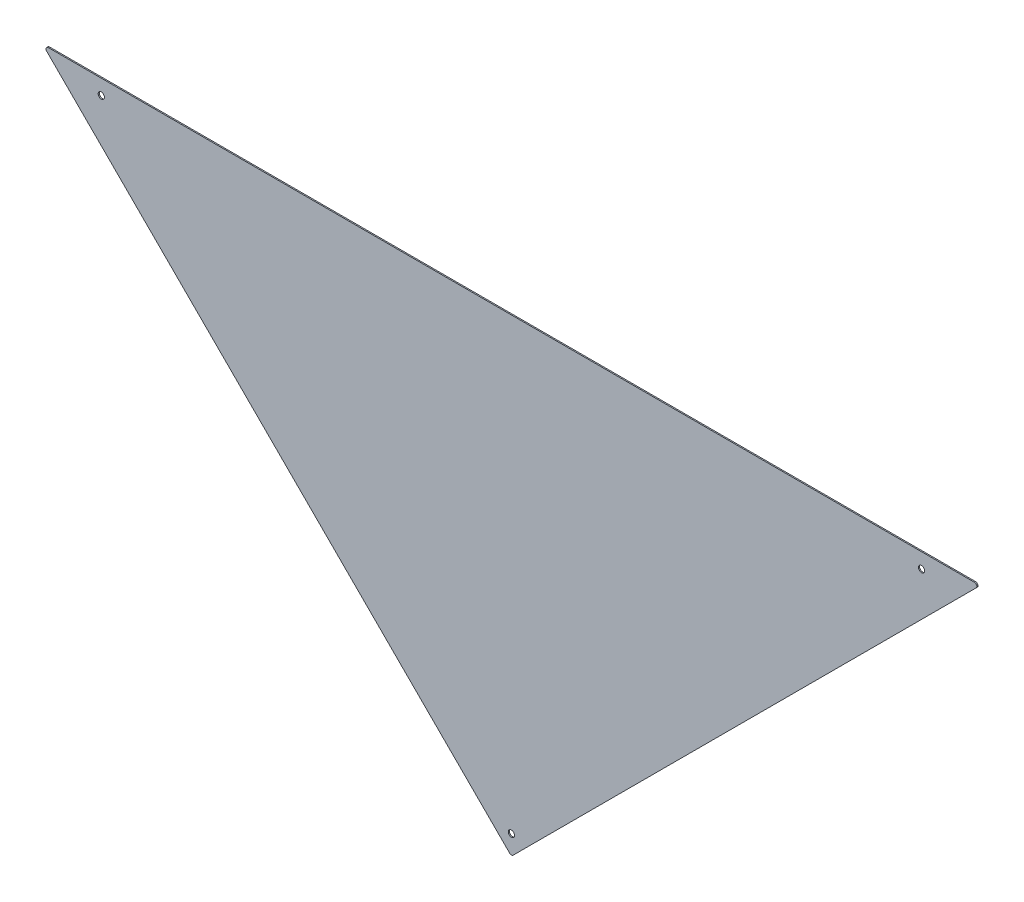
ISO-10303-21;
HEADER;
FILE_DESCRIPTION(('STEP AP214'),'2;1');
FILE_NAME('part.step','',(''),(''),'','','');
FILE_SCHEMA(('AUTOMOTIVE_DESIGN { 1 0 10303 214 1 1 1 1 }'));
ENDSEC;
DATA;
#1=APPLICATION_CONTEXT('core data for automotive mechanical design processes');
#2=APPLICATION_PROTOCOL_DEFINITION('international standard','automotive_design',2000,#1);
#3=PRODUCT_CONTEXT('',#1,'mechanical');
#4=PRODUCT('Part','Part','',(#3));
#5=PRODUCT_RELATED_PRODUCT_CATEGORY('part','',(#4));
#6=PRODUCT_DEFINITION_FORMATION('','',#4);
#7=PRODUCT_DEFINITION_CONTEXT('part definition',#1,'design');
#8=PRODUCT_DEFINITION('design','',#6,#7);
#9=PRODUCT_DEFINITION_SHAPE('','',#8);
#10=(LENGTH_UNIT() NAMED_UNIT(*) SI_UNIT(.MILLI.,.METRE.));
#11=(NAMED_UNIT(*) PLANE_ANGLE_UNIT() SI_UNIT($,.RADIAN.));
#12=(NAMED_UNIT(*) SI_UNIT($,.STERADIAN.) SOLID_ANGLE_UNIT());
#13=UNCERTAINTY_MEASURE_WITH_UNIT(LENGTH_MEASURE(1.E-05),#10,'distance_accuracy_value','');
#14=(GEOMETRIC_REPRESENTATION_CONTEXT(3) GLOBAL_UNCERTAINTY_ASSIGNED_CONTEXT((#13)) GLOBAL_UNIT_ASSIGNED_CONTEXT((#10,
#11,#12)) REPRESENTATION_CONTEXT('',''));
#15=CARTESIAN_POINT('',(0.,0.,0.));
#16=DIRECTION('',(0.,0.,1.));
#17=DIRECTION('',(1.,0.,0.));
#18=AXIS2_PLACEMENT_3D('',#15,#16,#17);
#19=CARTESIAN_POINT('',(9.65894031423886E-12,8.48528137422899,1.50000000000006));
#20=DIRECTION('',(0.,0.,-1.));
#21=DIRECTION('',(-1.,0.,0.));
#22=AXIS2_PLACEMENT_3D('',#19,#20,#21);
#23=CYLINDRICAL_SURFACE('',#22,2.99999999999999);
#24=CARTESIAN_POINT('',(9.65894031423886E-12,8.48528137422899,0.));
#25=DIRECTION('',(0.,0.,1.));
#26=DIRECTION('',(1.,0.,0.));
#27=AXIS2_PLACEMENT_3D('',#24,#25,#26);
#28=CIRCLE('',#27,2.99999999999999);
#29=CARTESIAN_POINT('',(2.12132034356932,6.36396103066933,0.));
#30=VERTEX_POINT('',#29);
#31=CARTESIAN_POINT('',(-2.12132034355002,6.36396103066939,0.));
#32=VERTEX_POINT('',#31);
#33=EDGE_CURVE('E129',#30,#32,#28,.F.);
#34=ORIENTED_EDGE('',*,*,#33,.F.);
#35=DIRECTION('',(0.,0.,-1.));
#36=VECTOR('',#35,1.);
#37=CARTESIAN_POINT('',(2.12132034356932,6.36396103066933,1.50000000000006));
#38=LINE('',#37,#36);
#39=CARTESIAN_POINT('',(2.12132034356932,6.36396103066933,1.50000000000006));
#40=VERTEX_POINT('',#39);
#41=EDGE_CURVE('E11',#40,#30,#38,.T.);
#42=ORIENTED_EDGE('',*,*,#41,.F.);
#43=CARTESIAN_POINT('',(9.65894031423886E-12,8.48528137422899,1.50000000000006));
#44=DIRECTION('',(0.,0.,1.));
#45=DIRECTION('',(1.,0.,0.));
#46=AXIS2_PLACEMENT_3D('',#43,#44,#45);
#47=CIRCLE('',#46,2.99999999999999);
#48=CARTESIAN_POINT('',(-2.12132034355002,6.36396103066939,1.50000000000006));
#49=VERTEX_POINT('',#48);
#50=EDGE_CURVE('E195',#40,#49,#47,.F.);
#51=ORIENTED_EDGE('',*,*,#50,.T.);
#52=DIRECTION('',(0.,0.,-1.));
#53=VECTOR('',#52,1.);
#54=CARTESIAN_POINT('',(-2.12132034355002,6.36396103066939,1.50000000000006));
#55=LINE('',#54,#53);
#56=EDGE_CURVE('E79',#49,#32,#55,.T.);
#57=ORIENTED_EDGE('',*,*,#56,.T.);
#58=EDGE_LOOP('',(#34,#42,#51,#57));
#59=FACE_BOUND('',#58,.T.);
#60=ADVANCED_FACE('F34',(#59),#23,.T.);
#61=CARTESIAN_POINT('',(-2.12132034355001,2.12132034355001,1.50000000000006));
#62=DIRECTION('',(-0.707106781186548,0.707106781186547,0.));
#63=DIRECTION('',(-0.707106781186547,-0.707106781186548,0.));
#64=AXIS2_PLACEMENT_3D('',#61,#62,#63);
#65=PLANE('',#64);
#66=DIRECTION('',(0.707106781186547,0.707106781186548,0.));
#67=VECTOR('',#66,1.);
#68=CARTESIAN_POINT('',(-2.12132034355001,2.12132034355001,0.));
#69=LINE('',#68,#67);
#70=CARTESIAN_POINT('',(594.87867965645,599.12132034355,0.));
#71=VERTEX_POINT('',#70);
#72=EDGE_CURVE('E127',#30,#71,#69,.T.);
#73=ORIENTED_EDGE('',*,*,#72,.T.);
#74=DIRECTION('',(0.,0.,-1.));
#75=VECTOR('',#74,1.);
#76=CARTESIAN_POINT('',(594.87867965645,599.12132034355,1.50000000000006));
#77=LINE('',#76,#75);
#78=CARTESIAN_POINT('',(594.87867965645,599.12132034355,1.50000000000006));
#79=VERTEX_POINT('',#78);
#80=EDGE_CURVE('E43',#79,#71,#77,.T.);
#81=ORIENTED_EDGE('',*,*,#80,.F.);
#82=DIRECTION('',(0.707106781186547,0.707106781186548,0.));
#83=VECTOR('',#82,1.);
#84=CARTESIAN_POINT('',(-2.12132034355001,2.12132034355001,1.50000000000006));
#85=LINE('',#84,#83);
#86=EDGE_CURVE('E197',#40,#79,#85,.T.);
#87=ORIENTED_EDGE('',*,*,#86,.F.);
#88=ORIENTED_EDGE('',*,*,#41,.T.);
#89=EDGE_LOOP('',(#73,#81,#87,#88));
#90=FACE_BOUND('',#89,.T.);
#91=ADVANCED_FACE('F128',(#90),#65,.F.);
#92=CARTESIAN_POINT('',(592.75735931289,601.24264068711,1.50000000000006));
#93=DIRECTION('',(0.,0.,-1.));
#94=DIRECTION('',(-1.,0.,0.));
#95=AXIS2_PLACEMENT_3D('',#92,#93,#94);
#96=CYLINDRICAL_SURFACE('',#95,3.00000000000003);
#97=CARTESIAN_POINT('',(592.75735931289,601.24264068711,0.));
#98=DIRECTION('',(0.,0.,1.));
#99=DIRECTION('',(1.,0.,0.));
#100=AXIS2_PLACEMENT_3D('',#97,#98,#99);
#101=CIRCLE('',#100,3.00000000000003);
#102=CARTESIAN_POINT('',(592.75735931289,604.24264068711,0.));
#103=VERTEX_POINT('',#102);
#104=EDGE_CURVE('E124',#71,#103,#101,.T.);
#105=ORIENTED_EDGE('',*,*,#104,.T.);
#106=DIRECTION('',(0.,0.,-1.));
#107=VECTOR('',#106,1.);
#108=CARTESIAN_POINT('',(592.75735931289,604.24264068711,1.50000000000006));
#109=LINE('',#108,#107);
#110=CARTESIAN_POINT('',(592.75735931289,604.24264068711,1.50000000000006));
#111=VERTEX_POINT('',#110);
#112=EDGE_CURVE('E113',#111,#103,#109,.T.);
#113=ORIENTED_EDGE('',*,*,#112,.F.);
#114=CARTESIAN_POINT('',(592.75735931289,601.24264068711,1.50000000000006));
#115=DIRECTION('',(0.,0.,1.));
#116=DIRECTION('',(1.,0.,0.));
#117=AXIS2_PLACEMENT_3D('',#114,#115,#116);
#118=CIRCLE('',#117,3.00000000000003);
#119=EDGE_CURVE('E106',#79,#111,#118,.T.);
#120=ORIENTED_EDGE('',*,*,#119,.F.);
#121=ORIENTED_EDGE('',*,*,#80,.T.);
#122=EDGE_LOOP('',(#105,#113,#120,#121));
#123=FACE_BOUND('',#122,.T.);
#124=ADVANCED_FACE('F123',(#123),#96,.T.);
#125=CARTESIAN_POINT('',(-1.13173473363328E-13,604.24264068711,1.50000000000006));
#126=DIRECTION('',(0.,-1.,0.));
#127=DIRECTION('',(1.,0.,0.));
#128=AXIS2_PLACEMENT_3D('',#125,#126,#127);
#129=PLANE('',#128);
#130=DIRECTION('',(-1.,0.,0.));
#131=VECTOR('',#130,1.);
#132=CARTESIAN_POINT('',(-1.13173473363328E-13,604.24264068711,0.));
#133=LINE('',#132,#131);
#134=CARTESIAN_POINT('',(-592.757359312871,604.242640687109,0.));
#135=VERTEX_POINT('',#134);
#136=EDGE_CURVE('E112',#103,#135,#133,.T.);
#137=ORIENTED_EDGE('',*,*,#136,.T.);
#138=DIRECTION('',(0.,0.,-1.));
#139=VECTOR('',#138,1.);
#140=CARTESIAN_POINT('',(-592.757359312871,604.242640687109,1.50000000000006));
#141=LINE('',#140,#139);
#142=CARTESIAN_POINT('',(-592.757359312871,604.242640687109,1.50000000000006));
#143=VERTEX_POINT('',#142);
#144=EDGE_CURVE('E98',#143,#135,#141,.T.);
#145=ORIENTED_EDGE('',*,*,#144,.F.);
#146=DIRECTION('',(-1.,0.,0.));
#147=VECTOR('',#146,1.);
#148=CARTESIAN_POINT('',(-1.13173473363328E-13,604.24264068711,1.50000000000006));
#149=LINE('',#148,#147);
#150=EDGE_CURVE('E101',#111,#143,#149,.T.);
#151=ORIENTED_EDGE('',*,*,#150,.F.);
#152=ORIENTED_EDGE('',*,*,#112,.T.);
#153=EDGE_LOOP('',(#137,#145,#151,#152));
#154=FACE_BOUND('',#153,.T.);
#155=ADVANCED_FACE('F111',(#154),#129,.F.);
#156=CARTESIAN_POINT('',(-592.757359312871,601.24264068711,1.50000000000006));
#157=DIRECTION('',(0.,0.,-1.));
#158=DIRECTION('',(-1.,0.,0.));
#159=AXIS2_PLACEMENT_3D('',#156,#157,#158);
#160=CYLINDRICAL_SURFACE('',#159,2.99999999999992);
#161=CARTESIAN_POINT('',(-592.757359312871,601.24264068711,0.));
#162=DIRECTION('',(0.,0.,1.));
#163=DIRECTION('',(1.,0.,0.));
#164=AXIS2_PLACEMENT_3D('',#161,#162,#163);
#165=CIRCLE('',#164,2.99999999999992);
#166=CARTESIAN_POINT('',(-594.878679656431,599.12132034355,0.));
#167=VERTEX_POINT('',#166);
#168=EDGE_CURVE('E137',#135,#167,#165,.T.);
#169=ORIENTED_EDGE('',*,*,#168,.T.);
#170=DIRECTION('',(0.,0.,-1.));
#171=VECTOR('',#170,1.);
#172=CARTESIAN_POINT('',(-594.878679656431,599.12132034355,1.50000000000006));
#173=LINE('',#172,#171);
#174=CARTESIAN_POINT('',(-594.878679656431,599.12132034355,1.50000000000006));
#175=VERTEX_POINT('',#174);
#176=EDGE_CURVE('E100',#175,#167,#173,.T.);
#177=ORIENTED_EDGE('',*,*,#176,.F.);
#178=CARTESIAN_POINT('',(-592.757359312871,601.24264068711,1.50000000000006));
#179=DIRECTION('',(0.,0.,1.));
#180=DIRECTION('',(1.,0.,0.));
#181=AXIS2_PLACEMENT_3D('',#178,#179,#180);
#182=CIRCLE('',#181,2.99999999999992);
#183=EDGE_CURVE('E93',#143,#175,#182,.T.);
#184=ORIENTED_EDGE('',*,*,#183,.F.);
#185=ORIENTED_EDGE('',*,*,#144,.T.);
#186=EDGE_LOOP('',(#169,#177,#184,#185));
#187=FACE_BOUND('',#186,.T.);
#188=ADVANCED_FACE('F96',(#187),#160,.T.);
#189=CARTESIAN_POINT('',(-525.000000000019,585.,1.50000000000006));
#190=DIRECTION('',(0.,0.,-1.));
#191=DIRECTION('',(-1.,0.,0.));
#192=AXIS2_PLACEMENT_3D('',#189,#190,#191);
#193=CYLINDRICAL_SURFACE('',#192,3.99999999999999);
#194=CARTESIAN_POINT('',(-525.000000000019,585.,1.50000000000006));
#195=DIRECTION('',(0.,0.,1.));
#196=DIRECTION('',(1.,0.,0.));
#197=AXIS2_PLACEMENT_3D('',#194,#195,#196);
#198=CIRCLE('',#197,3.99999999999999);
#199=CARTESIAN_POINT('',(-521.000000000019,585.,1.50000000000006));
#200=VERTEX_POINT('',#199);
#201=EDGE_CURVE('E194',#200,#200,#198,.T.);
#202=ORIENTED_EDGE('',*,*,#201,.T.);
#203=EDGE_LOOP('',(#202));
#204=FACE_BOUND('',#203,.T.);
#205=CARTESIAN_POINT('',(-525.000000000019,585.,0.));
#206=DIRECTION('',(0.,0.,1.));
#207=DIRECTION('',(1.,0.,0.));
#208=AXIS2_PLACEMENT_3D('',#205,#206,#207);
#209=CIRCLE('',#208,3.99999999999999);
#210=CARTESIAN_POINT('',(-521.000000000019,585.,0.));
#211=VERTEX_POINT('',#210);
#212=EDGE_CURVE('E132',#211,#211,#209,.T.);
#213=ORIENTED_EDGE('',*,*,#212,.F.);
#214=EDGE_LOOP('',(#213));
#215=FACE_BOUND('',#214,.T.);
#216=ADVANCED_FACE('F152',(#204,#215),#193,.F.);
#217=CARTESIAN_POINT('',(525.000000000019,585.,1.50000000000006));
#218=DIRECTION('',(0.,0.,-1.));
#219=DIRECTION('',(-1.,0.,0.));
#220=AXIS2_PLACEMENT_3D('',#217,#218,#219);
#221=CYLINDRICAL_SURFACE('',#220,3.99999999999999);
#222=CARTESIAN_POINT('',(525.000000000019,585.,1.50000000000006));
#223=DIRECTION('',(0.,0.,1.));
#224=DIRECTION('',(1.,0.,0.));
#225=AXIS2_PLACEMENT_3D('',#222,#223,#224);
#226=CIRCLE('',#225,3.99999999999999);
#227=CARTESIAN_POINT('',(529.000000000019,585.,1.50000000000006));
#228=VERTEX_POINT('',#227);
#229=EDGE_CURVE('E192',#228,#228,#226,.T.);
#230=ORIENTED_EDGE('',*,*,#229,.T.);
#231=EDGE_LOOP('',(#230));
#232=FACE_BOUND('',#231,.T.);
#233=CARTESIAN_POINT('',(525.000000000019,585.,0.));
#234=DIRECTION('',(0.,0.,1.));
#235=DIRECTION('',(1.,0.,0.));
#236=AXIS2_PLACEMENT_3D('',#233,#234,#235);
#237=CIRCLE('',#236,3.99999999999999);
#238=CARTESIAN_POINT('',(529.000000000019,585.,0.));
#239=VERTEX_POINT('',#238);
#240=EDGE_CURVE('E145',#239,#239,#237,.T.);
#241=ORIENTED_EDGE('',*,*,#240,.F.);
#242=EDGE_LOOP('',(#241));
#243=FACE_BOUND('',#242,.T.);
#244=ADVANCED_FACE('F154',(#232,#243),#221,.F.);
#245=CARTESIAN_POINT('',(-2.49800180540661E-13,29.2426406871193,1.50000000000006));
#246=DIRECTION('',(0.,0.,-1.));
#247=DIRECTION('',(-1.,0.,0.));
#248=AXIS2_PLACEMENT_3D('',#245,#246,#247);
#249=CYLINDRICAL_SURFACE('',#248,4.);
#250=CARTESIAN_POINT('',(-2.49800180540661E-13,29.2426406871193,1.50000000000006));
#251=DIRECTION('',(0.,0.,1.));
#252=DIRECTION('',(1.,0.,0.));
#253=AXIS2_PLACEMENT_3D('',#250,#251,#252);
#254=CIRCLE('',#253,4.);
#255=CARTESIAN_POINT('',(3.99999999999975,29.2426406871193,1.50000000000006));
#256=VERTEX_POINT('',#255);
#257=EDGE_CURVE('E139',#256,#256,#254,.T.);
#258=ORIENTED_EDGE('',*,*,#257,.T.);
#259=EDGE_LOOP('',(#258));
#260=FACE_BOUND('',#259,.T.);
#261=CARTESIAN_POINT('',(-2.49800180540661E-13,29.2426406871193,0.));
#262=DIRECTION('',(0.,0.,1.));
#263=DIRECTION('',(1.,0.,0.));
#264=AXIS2_PLACEMENT_3D('',#261,#262,#263);
#265=CIRCLE('',#264,4.);
#266=CARTESIAN_POINT('',(3.99999999999975,29.2426406871193,0.));
#267=VERTEX_POINT('',#266);
#268=EDGE_CURVE('E142',#267,#267,#265,.T.);
#269=ORIENTED_EDGE('',*,*,#268,.F.);
#270=EDGE_LOOP('',(#269));
#271=FACE_BOUND('',#270,.T.);
#272=ADVANCED_FACE('F36',(#260,#271),#249,.F.);
#273=CARTESIAN_POINT('',(2.12132034355968,2.12132034355968,1.50000000000006));
#274=DIRECTION('',(0.707106781186547,0.707106781186548,0.));
#275=DIRECTION('',(-0.707106781186548,0.707106781186547,0.));
#276=AXIS2_PLACEMENT_3D('',#273,#274,#275);
#277=PLANE('',#276);
#278=DIRECTION('',(0.707106781186548,-0.707106781186547,0.));
#279=VECTOR('',#278,1.);
#280=CARTESIAN_POINT('',(2.12132034355968,2.12132034355968,0.));
#281=LINE('',#280,#279);
#282=EDGE_CURVE('E72',#167,#32,#281,.T.);
#283=ORIENTED_EDGE('',*,*,#282,.T.);
#284=ORIENTED_EDGE('',*,*,#56,.F.);
#285=DIRECTION('',(0.707106781186548,-0.707106781186547,0.));
#286=VECTOR('',#285,1.);
#287=CARTESIAN_POINT('',(2.12132034355968,2.12132034355968,1.50000000000006));
#288=LINE('',#287,#286);
#289=EDGE_CURVE('E51',#175,#49,#288,.T.);
#290=ORIENTED_EDGE('',*,*,#289,.F.);
#291=ORIENTED_EDGE('',*,*,#176,.T.);
#292=EDGE_LOOP('',(#283,#284,#290,#291));
#293=FACE_BOUND('',#292,.T.);
#294=ADVANCED_FACE('F175',(#293),#277,.F.);
#295=CARTESIAN_POINT('',(0.,0.,1.50000000000006));
#296=DIRECTION('',(0.,0.,1.));
#297=DIRECTION('',(1.,0.,0.));
#298=AXIS2_PLACEMENT_3D('',#295,#296,#297);
#299=PLANE('',#298);
#300=ORIENTED_EDGE('',*,*,#257,.F.);
#301=EDGE_LOOP('',(#300));
#302=FACE_BOUND('',#301,.T.);
#303=ORIENTED_EDGE('',*,*,#229,.F.);
#304=EDGE_LOOP('',(#303));
#305=FACE_BOUND('',#304,.T.);
#306=ORIENTED_EDGE('',*,*,#201,.F.);
#307=EDGE_LOOP('',(#306));
#308=FACE_BOUND('',#307,.T.);
#309=ORIENTED_EDGE('',*,*,#50,.F.);
#310=ORIENTED_EDGE('',*,*,#86,.T.);
#311=ORIENTED_EDGE('',*,*,#119,.T.);
#312=ORIENTED_EDGE('',*,*,#150,.T.);
#313=ORIENTED_EDGE('',*,*,#183,.T.);
#314=ORIENTED_EDGE('',*,*,#289,.T.);
#315=EDGE_LOOP('',(#309,#310,#311,#312,#313,#314));
#316=FACE_BOUND('',#315,.T.);
#317=ADVANCED_FACE('F104',(#302,#305,#308,#316),#299,.T.);
#318=CARTESIAN_POINT('',(0.,0.,0.));
#319=DIRECTION('',(0.,0.,1.));
#320=DIRECTION('',(1.,0.,0.));
#321=AXIS2_PLACEMENT_3D('',#318,#319,#320);
#322=PLANE('',#321);
#323=ORIENTED_EDGE('',*,*,#268,.T.);
#324=EDGE_LOOP('',(#323));
#325=FACE_BOUND('',#324,.T.);
#326=ORIENTED_EDGE('',*,*,#240,.T.);
#327=EDGE_LOOP('',(#326));
#328=FACE_BOUND('',#327,.T.);
#329=ORIENTED_EDGE('',*,*,#212,.T.);
#330=EDGE_LOOP('',(#329));
#331=FACE_BOUND('',#330,.T.);
#332=ORIENTED_EDGE('',*,*,#33,.T.);
#333=ORIENTED_EDGE('',*,*,#282,.F.);
#334=ORIENTED_EDGE('',*,*,#168,.F.);
#335=ORIENTED_EDGE('',*,*,#136,.F.);
#336=ORIENTED_EDGE('',*,*,#104,.F.);
#337=ORIENTED_EDGE('',*,*,#72,.F.);
#338=EDGE_LOOP('',(#332,#333,#334,#335,#336,#337));
#339=FACE_BOUND('',#338,.T.);
#340=ADVANCED_FACE('F150',(#325,#328,#331,#339),#322,.F.);
#341=CLOSED_SHELL('',(#60,#91,#124,#155,#188,#216,#244,#272,#294,#317,#340));
#342=MANIFOLD_SOLID_BREP('B2',#341);
#343=ADVANCED_BREP_SHAPE_REPRESENTATION('',(#18,#342),#14);
#344=SHAPE_DEFINITION_REPRESENTATION(#9,#343);
ENDSEC;
END-ISO-10303-21;
